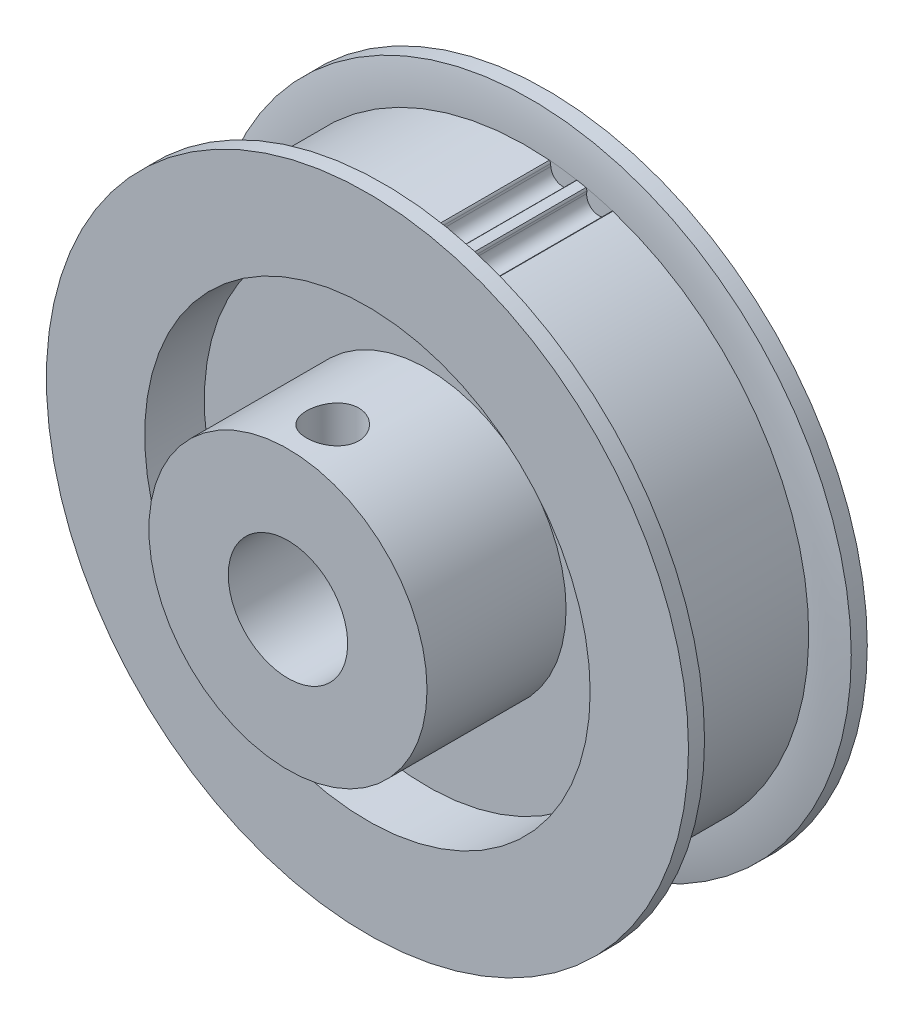
ISO-10303-21;
HEADER;
FILE_DESCRIPTION(('STEP AP214'),'2;1');
FILE_NAME('part.step','',(''),(''),'','','');
FILE_SCHEMA(('AUTOMOTIVE_DESIGN { 1 0 10303 214 1 1 1 1 }'));
ENDSEC;
DATA;
#1=APPLICATION_CONTEXT('core data for automotive mechanical design processes');
#2=APPLICATION_PROTOCOL_DEFINITION('international standard','automotive_design',2000,#1);
#3=PRODUCT_CONTEXT('',#1,'mechanical');
#4=PRODUCT('Part','Part','',(#3));
#5=PRODUCT_RELATED_PRODUCT_CATEGORY('part','',(#4));
#6=PRODUCT_DEFINITION_FORMATION('','',#4);
#7=PRODUCT_DEFINITION_CONTEXT('part definition',#1,'design');
#8=PRODUCT_DEFINITION('design','',#6,#7);
#9=PRODUCT_DEFINITION_SHAPE('','',#8);
#10=(LENGTH_UNIT() NAMED_UNIT(*) SI_UNIT(.MILLI.,.METRE.));
#11=(NAMED_UNIT(*) PLANE_ANGLE_UNIT() SI_UNIT($,.RADIAN.));
#12=(NAMED_UNIT(*) SI_UNIT($,.STERADIAN.) SOLID_ANGLE_UNIT());
#13=UNCERTAINTY_MEASURE_WITH_UNIT(LENGTH_MEASURE(1.E-05),#10,'distance_accuracy_value','');
#14=(GEOMETRIC_REPRESENTATION_CONTEXT(3) GLOBAL_UNCERTAINTY_ASSIGNED_CONTEXT((#13)) GLOBAL_UNIT_ASSIGNED_CONTEXT((#10,
#11,#12)) REPRESENTATION_CONTEXT('',''));
#15=CARTESIAN_POINT('',(0.,0.,0.));
#16=DIRECTION('',(0.,0.,1.));
#17=DIRECTION('',(1.,0.,0.));
#18=AXIS2_PLACEMENT_3D('',#15,#16,#17);
#19=CARTESIAN_POINT('',(0.,0.,13.49375));
#20=DIRECTION('',(0.,0.,-1.));
#21=DIRECTION('',(-1.,0.,0.));
#22=AXIS2_PLACEMENT_3D('',#19,#20,#21);
#23=CYLINDRICAL_SURFACE('',#22,4.76885);
#24=CARTESIAN_POINT('',(0.,0.,13.49375));
#25=DIRECTION('',(0.,0.,-1.));
#26=DIRECTION('',(-1.,0.,0.));
#27=AXIS2_PLACEMENT_3D('',#24,#25,#26);
#28=CIRCLE('',#27,4.76885);
#29=CARTESIAN_POINT('',(-4.76885,0.,13.49375));
#30=VERTEX_POINT('',#29);
#31=EDGE_CURVE('E617',#30,#30,#28,.T.);
#32=ORIENTED_EDGE('',*,*,#31,.F.);
#33=EDGE_LOOP('',(#32));
#34=FACE_BOUND('',#33,.T.);
#35=CARTESIAN_POINT('',(0.,0.,-7.14375));
#36=DIRECTION('',(0.,0.,-1.));
#37=DIRECTION('',(-1.,0.,0.));
#38=AXIS2_PLACEMENT_3D('',#35,#36,#37);
#39=CIRCLE('',#38,4.76885);
#40=CARTESIAN_POINT('',(-4.76885,0.,-7.14375));
#41=VERTEX_POINT('',#40);
#42=EDGE_CURVE('E254',#41,#41,#39,.T.);
#43=ORIENTED_EDGE('',*,*,#42,.T.);
#44=EDGE_LOOP('',(#43));
#45=FACE_BOUND('',#44,.T.);
#46=CARTESIAN_POINT('',(2.0828,4.28997371582857,9.921875));
#47=CARTESIAN_POINT('',(2.08279309475107,4.28998136636962,9.81124000228478));
#48=CARTESIAN_POINT('',(2.07393724770838,4.29431169526409,9.70051711326352));
#49=CARTESIAN_POINT('',(2.03891106593472,4.31104709896414,9.48239841307775));
#50=CARTESIAN_POINT('',(2.01271636747168,4.32346353558831,9.37500750646702));
#51=CARTESIAN_POINT('',(1.94425530841367,4.35467546817126,9.166974972437));
#52=CARTESIAN_POINT('',(1.90205167020731,4.37344603839647,9.06630878542764));
#53=CARTESIAN_POINT('',(1.80296547129025,4.41521536590945,8.8734792022932));
#54=CARTESIAN_POINT('',(1.74608108282824,4.43821464956885,8.78131686683734));
#55=CARTESIAN_POINT('',(1.61509684839342,4.48760300327386,8.60179281080022));
#56=CARTESIAN_POINT('',(1.54014765591728,4.5141138652434,8.51508404194297));
#57=CARTESIAN_POINT('',(1.37694542274111,4.56654080600722,8.35498283207335));
#58=CARTESIAN_POINT('',(1.28868783966035,4.5924566782279,8.28159495662932));
#59=CARTESIAN_POINT('',(1.09611831900581,4.64228433201052,8.14675565118863));
#60=CARTESIAN_POINT('',(0.991235223335877,4.66603787869313,8.08605608541773));
#61=CARTESIAN_POINT('',(0.771518415837138,4.70735109900776,7.98344922382903));
#62=CARTESIAN_POINT('',(0.656689464209303,4.72491371550679,7.94153299674875));
#63=CARTESIAN_POINT('',(0.42722385490403,4.75099776016712,7.88010275559826));
#64=CARTESIAN_POINT('',(0.312943081020079,4.75997405368847,7.85945656701402));
#65=CARTESIAN_POINT('',(0.0822107175918864,4.76953667799242,7.83747816722956));
#66=CARTESIAN_POINT('',(-0.0342398790906929,4.77012675608798,7.83613732958494));
#67=CARTESIAN_POINT('',(-0.257713381386158,4.76310674430949,7.85224930423773));
#68=CARTESIAN_POINT('',(-0.364846751639125,4.75604136106681,7.86845367292192));
#69=CARTESIAN_POINT('',(-0.574694702000241,4.73526956779998,7.91703497306919));
#70=CARTESIAN_POINT('',(-0.677408960381866,4.72156267513893,7.94941307987924));
#71=CARTESIAN_POINT('',(-0.877408037731759,4.68855252474446,8.02978386396776));
#72=CARTESIAN_POINT('',(-0.974585694051365,4.66916682238073,8.07800794639539));
#73=CARTESIAN_POINT('',(-1.15972227414466,4.62666293067236,8.18845916523614));
#74=CARTESIAN_POINT('',(-1.24767811416495,4.60354349930132,8.25069096404345));
#75=CARTESIAN_POINT('',(-1.41901082161496,4.5537778609263,8.39289337195162));
#76=CARTESIAN_POINT('',(-1.50152746103705,4.52699715512335,8.47385460848099));
#77=CARTESIAN_POINT('',(-1.65222780204918,4.47419993477714,8.64848930125989));
#78=CARTESIAN_POINT('',(-1.72040134774708,4.44818397286319,8.74217168824116));
#79=CARTESIAN_POINT('',(-1.84301917063421,4.39883602032637,8.94420057582878));
#80=CARTESIAN_POINT('',(-1.8968111805748,4.37565152920985,9.05298150214687));
#81=CARTESIAN_POINT('',(-1.98487978628287,4.33642034618802,9.27924646524431));
#82=CARTESIAN_POINT('',(-2.01919900299857,4.32035808253735,9.39671085373599));
#83=CARTESIAN_POINT('',(-2.05618980521605,4.302813946919,9.58311756240282));
#84=CARTESIAN_POINT('',(-2.06614873049357,4.29802447726948,9.65038075429822));
#85=CARTESIAN_POINT('',(-2.07945583391956,4.29160206405149,9.78570988346239));
#86=CARTESIAN_POINT('',(-2.08280425039088,4.28996900668771,9.85377579170252));
#87=CARTESIAN_POINT('',(-2.08279309475107,4.28998136636962,10.0325099977152));
#88=CARTESIAN_POINT('',(-2.07393724770838,4.29431169526409,10.1432328867365));
#89=CARTESIAN_POINT('',(-2.03891106593472,4.31104709896414,10.3613515869223));
#90=CARTESIAN_POINT('',(-2.01271636747168,4.32346353558831,10.468742493533));
#91=CARTESIAN_POINT('',(-1.94425530841367,4.35467546817126,10.676775027563));
#92=CARTESIAN_POINT('',(-1.90205167020731,4.37344603839647,10.7774412145724));
#93=CARTESIAN_POINT('',(-1.80296547129025,4.41521536590945,10.9702707977068));
#94=CARTESIAN_POINT('',(-1.74608108282824,4.43821464956885,11.0624331331627));
#95=CARTESIAN_POINT('',(-1.61509684839342,4.48760300327386,11.2419571891998));
#96=CARTESIAN_POINT('',(-1.54014765591728,4.5141138652434,11.328665958057));
#97=CARTESIAN_POINT('',(-1.37694542274111,4.56654080600722,11.4887671679267));
#98=CARTESIAN_POINT('',(-1.28868783966035,4.5924566782279,11.5621550433707));
#99=CARTESIAN_POINT('',(-1.09611831900581,4.64228433201052,11.6969943488114));
#100=CARTESIAN_POINT('',(-0.991235223335877,4.66603787869313,11.7576939145823));
#101=CARTESIAN_POINT('',(-0.771518415837138,4.70735109900776,11.860300776171));
#102=CARTESIAN_POINT('',(-0.656689464209303,4.72491371550679,11.9022170032512));
#103=CARTESIAN_POINT('',(-0.42722385490403,4.75099776016712,11.9636472444017));
#104=CARTESIAN_POINT('',(-0.312943081020079,4.75997405368847,11.984293432986));
#105=CARTESIAN_POINT('',(-0.0822107175918864,4.76953667799242,12.0062718327704));
#106=CARTESIAN_POINT('',(0.0342398790906928,4.77012675608798,12.0076126704151));
#107=CARTESIAN_POINT('',(0.257713381386158,4.76310674430949,11.9915006957623));
#108=CARTESIAN_POINT('',(0.364846751639126,4.75604136106681,11.9752963270781));
#109=CARTESIAN_POINT('',(0.574694702000241,4.73526956779998,11.9267150269308));
#110=CARTESIAN_POINT('',(0.677408960381866,4.72156267513893,11.8943369201208));
#111=CARTESIAN_POINT('',(0.877408037731759,4.68855252474446,11.8139661360322));
#112=CARTESIAN_POINT('',(0.974585694051366,4.66916682238073,11.7657420536046));
#113=CARTESIAN_POINT('',(1.15972227414466,4.62666293067236,11.6552908347639));
#114=CARTESIAN_POINT('',(1.24767811416495,4.60354349930132,11.5930590359565));
#115=CARTESIAN_POINT('',(1.41901082161496,4.5537778609263,11.4508566280484));
#116=CARTESIAN_POINT('',(1.50152746103705,4.52699715512335,11.369895391519));
#117=CARTESIAN_POINT('',(1.65222780204918,4.47419993477714,11.1952606987401));
#118=CARTESIAN_POINT('',(1.72040134774708,4.44818397286319,11.1015783117588));
#119=CARTESIAN_POINT('',(1.84301917063421,4.39883602032637,10.8995494241712));
#120=CARTESIAN_POINT('',(1.8968111805748,4.37565152920985,10.7907684978531));
#121=CARTESIAN_POINT('',(1.98487978628287,4.33642034618802,10.5645035347557));
#122=CARTESIAN_POINT('',(2.01919900299857,4.32035808253735,10.447039146264));
#123=CARTESIAN_POINT('',(2.05618980521605,4.302813946919,10.2606324375972));
#124=CARTESIAN_POINT('',(2.06614873049357,4.29802447726948,10.1933692457018));
#125=CARTESIAN_POINT('',(2.07945583391956,4.29160206405149,10.0580401165376));
#126=CARTESIAN_POINT('',(2.08280425039088,4.28996900668771,9.98997420829748));
#127=CARTESIAN_POINT('',(2.0828,4.28997371582857,9.921875));
#128=B_SPLINE_CURVE_WITH_KNOTS('',3,(#46,#47,#48,#49,#50,#51,#52,#53,#54,#55,#56,#57,#58,#59,
#60,#61,#62,#63,#64,#65,#66,#67,#68,#69,#70,#71,#72,#73,#74,#75,#76,#77,#78,#79,#80,#81,#82,#83,
#84,#85,#86,#87,#88,#89,#90,#91,#92,#93,#94,#95,#96,#97,#98,#99,#100,#101,#102,#103,#104,#105,
#106,#107,#108,#109,#110,#111,#112,#113,#114,#115,#116,#117,#118,#119,#120,#121,#122,#123,#124,
#125,#126,#127),.UNSPECIFIED.,.T.,.F.,(4,2,2,2,2,2,2,2,2,2,2,2,2,2,2,2,2,2,2,2,2,2,2,2,2,2,2,2,
2,2,2,2,2,2,2,2,2,2,2,2,4),(0.,0.331634089644654,0.663735167844799,0.994548306154675,
1.32540265053855,1.67679119125065,2.02829993948324,2.39686276450596,2.76525015568899,
3.11281830907529,3.46023114954032,3.7844552716246,4.10870295853275,4.43791344462378,
4.76723366914031,5.12165908020985,5.47633461036122,5.84508645370733,6.21302804927599,
6.41716628456894,6.6212971601115,6.95293124975616,7.2850323279563,7.61584546626618,
7.94669981065005,8.29808835136215,8.64959709959474,9.01815992461746,9.3865473158005,
9.73411546918679,10.0815283096518,10.4057524317361,10.7300001186443,11.0592106047353,
11.3885308292518,11.7429562403214,12.0976317704727,12.4663836138188,12.8343252093875,
13.0384634446804,13.242594320223),.UNSPECIFIED.);
#129=CARTESIAN_POINT('',(2.0828,4.28997371582857,9.921875));
#130=VERTEX_POINT('',#129);
#131=EDGE_CURVE('E20',#130,#130,#128,.T.);
#132=ORIENTED_EDGE('',*,*,#131,.T.);
#133=EDGE_LOOP('',(#132));
#134=FACE_BOUND('',#133,.T.);
#135=ADVANCED_FACE('F16',(#34,#45,#134),#23,.F.);
#136=CARTESIAN_POINT('',(0.,0.,9.921875));
#137=DIRECTION('',(0.,-1.,0.));
#138=DIRECTION('',(0.,0.,-1.));
#139=AXIS2_PLACEMENT_3D('',#136,#137,#138);
#140=CYLINDRICAL_SURFACE('',#139,2.0828);
#141=ORIENTED_EDGE('',*,*,#131,.F.);
#142=EDGE_LOOP('',(#141));
#143=FACE_BOUND('',#142,.T.);
#144=CARTESIAN_POINT('',(-2.0828,10.9155668845003,9.921875));
#145=CARTESIAN_POINT('',(-2.08279451870322,10.9155695521147,9.80610890856088));
#146=CARTESIAN_POINT('',(-2.07310680750056,10.9174302445742,9.69019737118905));
#147=CARTESIAN_POINT('',(-2.03461261859953,10.9246682364328,9.46155217987826));
#148=CARTESIAN_POINT('',(-2.00576784142357,10.9300525801229,9.34882536457389));
#149=CARTESIAN_POINT('',(-1.92987369555913,10.9437068297346,9.13002570161695));
#150=CARTESIAN_POINT('',(-1.88284938227105,10.9519727626584,9.02394392844773));
#151=CARTESIAN_POINT('',(-1.77199008673206,10.9704535051151,8.82121361348785));
#152=CARTESIAN_POINT('',(-1.70816089154809,10.9806676434152,8.72456183997905));
#153=CARTESIAN_POINT('',(-1.5646436596476,11.0020386436127,8.54217916164302));
#154=CARTESIAN_POINT('',(-1.48478526113422,11.0132048198182,8.45658337469522));
#155=CARTESIAN_POINT('',(-1.3118409728471,11.035139941498,8.29991783911949));
#156=CARTESIAN_POINT('',(-1.21875352149877,11.0459088398878,8.22884980778506));
#157=CARTESIAN_POINT('',(-1.02111982731094,11.0659339759225,8.10275106500442));
#158=CARTESIAN_POINT('',(-0.916491961362516,11.0751781098486,8.04784619386589));
#159=CARTESIAN_POINT('',(-0.699295780220666,11.0910090900187,7.95644377447584));
#160=CARTESIAN_POINT('',(-0.58672818619914,11.0975961772402,7.91994455687191));
#161=CARTESIAN_POINT('',(-0.358233822198065,11.1073058426618,7.86680260357779));
#162=CARTESIAN_POINT('',(-0.242361216770013,11.1104677510987,7.84993428163922));
#163=CARTESIAN_POINT('',(-0.00939016334509482,11.1131063593726,7.83583007589002));
#164=CARTESIAN_POINT('',(0.107708181484871,11.1125833669059,7.83859255287026));
#165=CARTESIAN_POINT('',(0.338258489104642,11.1079418438482,7.8634984603065));
#166=CARTESIAN_POINT('',(0.451737748701682,11.1038684079209,7.88539882681622));
#167=CARTESIAN_POINT('',(0.673382534098426,11.09263422991,7.94757472598846));
#168=CARTESIAN_POINT('',(0.781547824715982,11.0854733513213,7.98785107111295));
#169=CARTESIAN_POINT('',(0.990201637324353,11.0687932654257,8.08586873769446));
#170=CARTESIAN_POINT('',(1.09064315927851,11.0592609177952,8.1437077818697));
#171=CARTESIAN_POINT('',(1.28047813331861,11.0388930508956,8.27513241261653));
#172=CARTESIAN_POINT('',(1.36987128932932,11.0280574967184,8.34871842103258));
#173=CARTESIAN_POINT('',(1.53650535903474,11.0060887717127,8.51087320783914));
#174=CARTESIAN_POINT('',(1.61354176261637,10.9949535787603,8.59965198762546));
#175=CARTESIAN_POINT('',(1.75169654089587,10.9737923157302,8.78902275492326));
#176=CARTESIAN_POINT('',(1.812807808816,10.9637667419773,8.88961998760357));
#177=CARTESIAN_POINT('',(1.91743194115483,10.9459556771624,9.10007098084264));
#178=CARTESIAN_POINT('',(1.96090068731682,10.9381758157479,9.20994712699055));
#179=CARTESIAN_POINT('',(2.02861617629656,10.9258215339763,9.43547957639696));
#180=CARTESIAN_POINT('',(2.05290347475795,10.9212403529896,9.5511231317761));
#181=CARTESIAN_POINT('',(2.07243261364606,10.917540695784,9.71000477658558));
#182=CARTESIAN_POINT('',(2.07631712132487,10.91680221567,9.75227643770354));
#183=CARTESIAN_POINT('',(2.08150182144548,10.9158148205245,9.83698387853684));
#184=CARTESIAN_POINT('',(2.08280201017694,10.9155659061959,9.87941965848772));
#185=CARTESIAN_POINT('',(2.08279451870322,10.9155695521147,10.0376410914391));
#186=CARTESIAN_POINT('',(2.07310680750056,10.9174302445742,10.1535526288109));
#187=CARTESIAN_POINT('',(2.03461261859953,10.9246682364328,10.3821978201217));
#188=CARTESIAN_POINT('',(2.00576784142357,10.9300525801229,10.4949246354261));
#189=CARTESIAN_POINT('',(1.92987369555913,10.9437068297346,10.7137242983831));
#190=CARTESIAN_POINT('',(1.88284938227105,10.9519727626584,10.8198060715523));
#191=CARTESIAN_POINT('',(1.77199008673206,10.9704535051151,11.0225363865121));
#192=CARTESIAN_POINT('',(1.70816089154809,10.9806676434152,11.119188160021));
#193=CARTESIAN_POINT('',(1.5646436596476,11.0020386436127,11.301570838357));
#194=CARTESIAN_POINT('',(1.48478526113422,11.0132048198182,11.3871666253048));
#195=CARTESIAN_POINT('',(1.31184097284709,11.035139941498,11.5438321608805));
#196=CARTESIAN_POINT('',(1.21875352149877,11.0459088398878,11.6149001922149));
#197=CARTESIAN_POINT('',(1.02111982731093,11.0659339759225,11.7409989349956));
#198=CARTESIAN_POINT('',(0.916491961362516,11.0751781098486,11.7959038061341));
#199=CARTESIAN_POINT('',(0.699295780220665,11.0910090900187,11.8873062255242));
#200=CARTESIAN_POINT('',(0.58672818619914,11.0975961772402,11.9238054431281));
#201=CARTESIAN_POINT('',(0.358233822198066,11.1073058426618,11.9769473964222));
#202=CARTESIAN_POINT('',(0.242361216770013,11.1104677510987,11.9938157183608));
#203=CARTESIAN_POINT('',(0.00939016334509513,11.1131063593726,12.00791992411));
#204=CARTESIAN_POINT('',(-0.10770818148487,11.1125833669059,12.0051574471297));
#205=CARTESIAN_POINT('',(-0.338258489104643,11.1079418438482,11.9802515396935));
#206=CARTESIAN_POINT('',(-0.451737748701682,11.1038684079209,11.9583511731838));
#207=CARTESIAN_POINT('',(-0.673382534098427,11.09263422991,11.8961752740115));
#208=CARTESIAN_POINT('',(-0.781547824715983,11.0854733513213,11.8558989288871));
#209=CARTESIAN_POINT('',(-0.990201637324354,11.0687932654257,11.7578812623055));
#210=CARTESIAN_POINT('',(-1.09064315927852,11.0592609177952,11.7000422181303));
#211=CARTESIAN_POINT('',(-1.28047813331861,11.0388930508956,11.5686175873835));
#212=CARTESIAN_POINT('',(-1.36987128932932,11.0280574967184,11.4950315789674));
#213=CARTESIAN_POINT('',(-1.53650535903474,11.0060887717127,11.3328767921609));
#214=CARTESIAN_POINT('',(-1.61354176261637,10.9949535787603,11.2440980123745));
#215=CARTESIAN_POINT('',(-1.75169654089587,10.9737923157302,11.0547272450767));
#216=CARTESIAN_POINT('',(-1.812807808816,10.9637667419773,10.9541300123964));
#217=CARTESIAN_POINT('',(-1.91743194115483,10.9459556771624,10.7436790191574));
#218=CARTESIAN_POINT('',(-1.96090068731682,10.9381758157479,10.6338028730094));
#219=CARTESIAN_POINT('',(-2.02861617629656,10.9258215339763,10.408270423603));
#220=CARTESIAN_POINT('',(-2.05290347475795,10.9212403529896,10.2926268682239));
#221=CARTESIAN_POINT('',(-2.07243261364606,10.917540695784,10.1337452234144));
#222=CARTESIAN_POINT('',(-2.07631712132487,10.91680221567,10.0914735622965));
#223=CARTESIAN_POINT('',(-2.08150182144548,10.9158148205245,10.0067661214632));
#224=CARTESIAN_POINT('',(-2.08280201017694,10.9155659061959,9.96433034151228));
#225=CARTESIAN_POINT('',(-2.0828,10.9155668845003,9.921875));
#226=B_SPLINE_CURVE_WITH_KNOTS('',3,(#144,#145,#146,#147,#148,#149,#150,#151,#152,#153,#154,
#155,#156,#157,#158,#159,#160,#161,#162,#163,#164,#165,#166,#167,#168,#169,#170,#171,#172,#173,
#174,#175,#176,#177,#178,#179,#180,#181,#182,#183,#184,#185,#186,#187,#188,#189,#190,#191,#192,
#193,#194,#195,#196,#197,#198,#199,#200,#201,#202,#203,#204,#205,#206,#207,#208,#209,#210,#211,
#212,#213,#214,#215,#216,#217,#218,#219,#220,#221,#222,#223,#224,#225),.UNSPECIFIED.,.T.,.F.,(4,
2,2,2,2,2,2,2,2,2,2,2,2,2,2,2,2,2,2,2,2,2,2,2,2,2,2,2,2,2,2,2,2,2,2,2,2,2,2,2,4),(0.,
0.347135951853942,0.694968007638515,1.04232237358082,1.38955727783036,1.7406992539826,
2.09188271387108,2.44573212721095,2.79954944141039,3.14925945218384,3.49894026184786,
3.84424340236253,4.18956181133509,4.53683799585514,4.88412348470043,5.2366676821906,
5.58936893826297,5.94294683128017,6.29577513243204,6.42308144505628,6.55038794045524,
6.89752389230918,7.24535594809375,7.59271031403605,7.9399452182856,8.29108719443784,
8.64227065432632,8.99612006766619,9.34993738186563,9.69964739263908,10.0493282023031,
10.3946313428178,10.7399497517903,11.0872259363104,11.4345114251557,11.7870556226458,
12.1397568787182,12.4933347717354,12.8461630728873,12.9734693855115,13.1007758809105),.UNSPECIFIED.);
#227=CARTESIAN_POINT('',(-2.0828,10.9155668845003,9.921875));
#228=VERTEX_POINT('',#227);
#229=EDGE_CURVE('E248',#228,#228,#226,.T.);
#230=ORIENTED_EDGE('',*,*,#229,.F.);
#231=EDGE_LOOP('',(#230));
#232=FACE_BOUND('',#231,.T.);
#233=ADVANCED_FACE('F255',(#143,#232),#140,.F.);
#234=CARTESIAN_POINT('',(0.,0.,13.49375));
#235=DIRECTION('',(0.,0.,1.));
#236=DIRECTION('',(1.,0.,0.));
#237=AXIS2_PLACEMENT_3D('',#234,#235,#236);
#238=PLANE('',#237);
#239=ORIENTED_EDGE('',*,*,#31,.T.);
#240=EDGE_LOOP('',(#239));
#241=FACE_BOUND('',#240,.T.);
#242=CARTESIAN_POINT('',(0.,0.,13.49375));
#243=DIRECTION('',(0.,0.,1.));
#244=DIRECTION('',(1.,0.,0.));
#245=AXIS2_PLACEMENT_3D('',#242,#243,#244);
#246=CIRCLE('',#245,11.1125);
#247=CARTESIAN_POINT('',(11.1125,0.,13.49375));
#248=VERTEX_POINT('',#247);
#249=EDGE_CURVE('E245',#248,#248,#246,.F.);
#250=ORIENTED_EDGE('',*,*,#249,.F.);
#251=EDGE_LOOP('',(#250));
#252=FACE_BOUND('',#251,.T.);
#253=ADVANCED_FACE('F268',(#241,#252),#238,.T.);
#254=CARTESIAN_POINT('',(0.,0.,-7.14375));
#255=DIRECTION('',(0.,0.,1.));
#256=DIRECTION('',(1.,0.,0.));
#257=AXIS2_PLACEMENT_3D('',#254,#255,#256);
#258=PLANE('',#257);
#259=ORIENTED_EDGE('',*,*,#42,.F.);
#260=EDGE_LOOP('',(#259));
#261=FACE_BOUND('',#260,.T.);
#262=CARTESIAN_POINT('',(0.,0.,-7.14375));
#263=DIRECTION('',(0.,0.,1.));
#264=DIRECTION('',(1.,0.,0.));
#265=AXIS2_PLACEMENT_3D('',#262,#263,#264);
#266=CIRCLE('',#265,11.1125);
#267=CARTESIAN_POINT('',(11.1125,0.,-7.14375));
#268=VERTEX_POINT('',#267);
#269=EDGE_CURVE('E152',#268,#268,#266,.T.);
#270=ORIENTED_EDGE('',*,*,#269,.F.);
#271=EDGE_LOOP('',(#270));
#272=FACE_BOUND('',#271,.T.);
#273=ADVANCED_FACE('F264',(#261,#272),#258,.F.);
#274=CARTESIAN_POINT('',(0.,0.,7.14375));
#275=DIRECTION('',(0.,0.,1.));
#276=DIRECTION('',(1.,0.,0.));
#277=AXIS2_PLACEMENT_3D('',#274,#275,#276);
#278=CYLINDRICAL_SURFACE('',#277,11.1125);
#279=CARTESIAN_POINT('',(0.,0.,2.38125));
#280=DIRECTION('',(0.,0.,1.));
#281=DIRECTION('',(1.,0.,0.));
#282=AXIS2_PLACEMENT_3D('',#279,#280,#281);
#283=CIRCLE('',#282,11.1125);
#284=CARTESIAN_POINT('',(11.1125,0.,2.38125));
#285=VERTEX_POINT('',#284);
#286=EDGE_CURVE('E157',#285,#285,#283,.F.);
#287=ORIENTED_EDGE('',*,*,#286,.F.);
#288=EDGE_LOOP('',(#287));
#289=FACE_BOUND('',#288,.T.);
#290=ORIENTED_EDGE('',*,*,#249,.T.);
#291=EDGE_LOOP('',(#290));
#292=FACE_BOUND('',#291,.T.);
#293=ORIENTED_EDGE('',*,*,#229,.T.);
#294=EDGE_LOOP('',(#293));
#295=FACE_BOUND('',#294,.T.);
#296=ADVANCED_FACE('F258',(#289,#292,#295),#278,.T.);
#297=CARTESIAN_POINT('',(0.,0.,-7.14375));
#298=DIRECTION('',(0.,0.,1.));
#299=DIRECTION('',(1.,0.,0.));
#300=AXIS2_PLACEMENT_3D('',#297,#298,#299);
#301=CYLINDRICAL_SURFACE('',#300,11.1125);
#302=CARTESIAN_POINT('',(0.,0.,-2.38125));
#303=DIRECTION('',(0.,0.,1.));
#304=DIRECTION('',(1.,0.,0.));
#305=AXIS2_PLACEMENT_3D('',#302,#303,#304);
#306=CIRCLE('',#305,11.1125);
#307=CARTESIAN_POINT('',(11.1125,0.,-2.38125));
#308=VERTEX_POINT('',#307);
#309=EDGE_CURVE('E119',#308,#308,#306,.F.);
#310=ORIENTED_EDGE('',*,*,#309,.T.);
#311=EDGE_LOOP('',(#310));
#312=FACE_BOUND('',#311,.T.);
#313=ORIENTED_EDGE('',*,*,#269,.T.);
#314=EDGE_LOOP('',(#313));
#315=FACE_BOUND('',#314,.T.);
#316=ADVANCED_FACE('F263',(#312,#315),#301,.T.);
#317=CARTESIAN_POINT('',(0.,0.,-5.55625));
#318=DIRECTION('',(0.,0.,1.));
#319=DIRECTION('',(1.,0.,0.));
#320=AXIS2_PLACEMENT_3D('',#317,#318,#319);
#321=CYLINDRICAL_SURFACE('',#320,22.56155);
#322=CARTESIAN_POINT('',(0.,0.,5.55625));
#323=DIRECTION('',(0.,0.,1.));
#324=DIRECTION('',(1.,0.,0.));
#325=AXIS2_PLACEMENT_3D('',#322,#323,#324);
#326=CIRCLE('',#325,22.56155);
#327=CARTESIAN_POINT('',(4.03965572018997,22.196952945502,5.55625));
#328=VERTEX_POINT('',#327);
#329=CARTESIAN_POINT('',(4.76225090295466,22.0532198270411,5.55625));
#330=VERTEX_POINT('',#329);
#331=EDGE_CURVE('E151',#328,#330,#326,.F.);
#332=ORIENTED_EDGE('',*,*,#331,.T.);
#333=DIRECTION('',(0.,0.,1.));
#334=VECTOR('',#333,1.);
#335=CARTESIAN_POINT('',(4.76225090295506,22.0532198270414,5.55625));
#336=LINE('',#335,#334);
#337=CARTESIAN_POINT('',(4.76225090295466,22.0532198270411,-5.55625));
#338=VERTEX_POINT('',#337);
#339=EDGE_CURVE('E142',#338,#330,#336,.T.);
#340=ORIENTED_EDGE('',*,*,#339,.F.);
#341=CARTESIAN_POINT('',(0.,0.,-5.55625));
#342=DIRECTION('',(0.,0.,1.));
#343=DIRECTION('',(1.,0.,0.));
#344=AXIS2_PLACEMENT_3D('',#341,#342,#343);
#345=CIRCLE('',#344,22.56155);
#346=CARTESIAN_POINT('',(4.03965572018997,22.196952945502,-5.55625));
#347=VERTEX_POINT('',#346);
#348=EDGE_CURVE('E148',#338,#347,#345,.T.);
#349=ORIENTED_EDGE('',*,*,#348,.T.);
#350=DIRECTION('',(0.,0.,1.));
#351=VECTOR('',#350,1.);
#352=CARTESIAN_POINT('',(4.03965572019035,22.1969529455014,5.55625));
#353=LINE('',#352,#351);
#354=EDGE_CURVE('E116',#328,#347,#353,.F.);
#355=ORIENTED_EDGE('',*,*,#354,.F.);
#356=EDGE_LOOP('',(#332,#340,#349,#355));
#357=FACE_BOUND('',#356,.T.);
#358=ADVANCED_FACE('F447',(#357),#321,.T.);
#359=CARTESIAN_POINT('',(0.,0.,2.38125));
#360=DIRECTION('',(0.,0.,1.));
#361=DIRECTION('',(1.,0.,0.));
#362=AXIS2_PLACEMENT_3D('',#359,#360,#361);
#363=PLANE('',#362);
#364=ORIENTED_EDGE('',*,*,#286,.T.);
#365=EDGE_LOOP('',(#364));
#366=FACE_BOUND('',#365,.T.);
#367=CARTESIAN_POINT('',(0.,0.,2.38125));
#368=DIRECTION('',(0.,0.,1.));
#369=DIRECTION('',(1.,0.,0.));
#370=AXIS2_PLACEMENT_3D('',#367,#368,#369);
#371=CIRCLE('',#370,17.79905);
#372=CARTESIAN_POINT('',(17.79905,0.,2.38125));
#373=VERTEX_POINT('',#372);
#374=EDGE_CURVE('E136',#373,#373,#371,.T.);
#375=ORIENTED_EDGE('',*,*,#374,.T.);
#376=EDGE_LOOP('',(#375));
#377=FACE_BOUND('',#376,.T.);
#378=ADVANCED_FACE('F444',(#366,#377),#363,.T.);
#379=CARTESIAN_POINT('',(0.,0.,-2.38125));
#380=DIRECTION('',(0.,0.,1.));
#381=DIRECTION('',(1.,0.,0.));
#382=AXIS2_PLACEMENT_3D('',#379,#380,#381);
#383=PLANE('',#382);
#384=ORIENTED_EDGE('',*,*,#309,.F.);
#385=EDGE_LOOP('',(#384));
#386=FACE_BOUND('',#385,.T.);
#387=CARTESIAN_POINT('',(0.,0.,-2.38125));
#388=DIRECTION('',(0.,0.,1.));
#389=DIRECTION('',(1.,0.,0.));
#390=AXIS2_PLACEMENT_3D('',#387,#388,#389);
#391=CIRCLE('',#390,17.79905);
#392=CARTESIAN_POINT('',(17.79905,0.,-2.38125));
#393=VERTEX_POINT('',#392);
#394=EDGE_CURVE('E133',#393,#393,#391,.F.);
#395=ORIENTED_EDGE('',*,*,#394,.T.);
#396=EDGE_LOOP('',(#395));
#397=FACE_BOUND('',#396,.T.);
#398=ADVANCED_FACE('F441',(#386,#397),#383,.F.);
#399=CARTESIAN_POINT('',(4.18184412263996,21.9331072773375,5.55625));
#400=DIRECTION('',(0.,0.,1.));
#401=DIRECTION('',(1.,0.,0.));
#402=AXIS2_PLACEMENT_3D('',#399,#400,#401);
#403=CYLINDRICAL_SURFACE('',#402,0.29972);
#404=CARTESIAN_POINT('',(4.18184412263996,21.9331072773375,5.55625));
#405=DIRECTION('',(0.,0.,1.));
#406=DIRECTION('',(1.,0.,0.));
#407=AXIS2_PLACEMENT_3D('',#404,#405,#406);
#408=CIRCLE('',#407,0.29972);
#409=CARTESIAN_POINT('',(3.89919571363085,22.0328166313852,5.55625));
#410=VERTEX_POINT('',#409);
#411=EDGE_CURVE('E104',#410,#328,#408,.F.);
#412=ORIENTED_EDGE('',*,*,#411,.T.);
#413=ORIENTED_EDGE('',*,*,#354,.T.);
#414=CARTESIAN_POINT('',(4.18184412263996,21.9331072773375,-5.55625));
#415=DIRECTION('',(0.,0.,1.));
#416=DIRECTION('',(1.,0.,0.));
#417=AXIS2_PLACEMENT_3D('',#414,#415,#416);
#418=CIRCLE('',#417,0.29972);
#419=CARTESIAN_POINT('',(3.89919571363085,22.0328166313852,-5.55625));
#420=VERTEX_POINT('',#419);
#421=EDGE_CURVE('E109',#347,#420,#418,.T.);
#422=ORIENTED_EDGE('',*,*,#421,.T.);
#423=DIRECTION('',(0.,0.,1.));
#424=VECTOR('',#423,1.);
#425=CARTESIAN_POINT('',(3.89919571363092,22.0328166313852,5.55625));
#426=LINE('',#425,#424);
#427=EDGE_CURVE('E113',#410,#420,#426,.F.);
#428=ORIENTED_EDGE('',*,*,#427,.F.);
#429=EDGE_LOOP('',(#412,#413,#422,#428));
#430=FACE_BOUND('',#429,.T.);
#431=ADVANCED_FACE('F111',(#430),#403,.T.);
#432=CARTESIAN_POINT('',(4.52991658226454,21.863871360374,5.55625));
#433=DIRECTION('',(0.,0.,1.));
#434=DIRECTION('',(1.,0.,0.));
#435=AXIS2_PLACEMENT_3D('',#432,#433,#434);
#436=CYLINDRICAL_SURFACE('',#435,0.29972);
#437=CARTESIAN_POINT('',(4.52991658226454,21.863871360374,-5.55625));
#438=DIRECTION('',(0.,0.,1.));
#439=DIRECTION('',(1.,0.,0.));
#440=AXIS2_PLACEMENT_3D('',#437,#438,#439);
#441=CIRCLE('',#440,0.29972);
#442=CARTESIAN_POINT('',(4.82920678009047,21.8478259284666,-5.55625));
#443=VERTEX_POINT('',#442);
#444=EDGE_CURVE('E145',#443,#338,#441,.T.);
#445=ORIENTED_EDGE('',*,*,#444,.T.);
#446=ORIENTED_EDGE('',*,*,#339,.T.);
#447=CARTESIAN_POINT('',(4.52991658226454,21.863871360374,5.55625));
#448=DIRECTION('',(0.,0.,1.));
#449=DIRECTION('',(1.,0.,0.));
#450=AXIS2_PLACEMENT_3D('',#447,#448,#449);
#451=CIRCLE('',#450,0.29972);
#452=CARTESIAN_POINT('',(4.82920678009047,21.8478259284666,5.55625));
#453=VERTEX_POINT('',#452);
#454=EDGE_CURVE('E161',#330,#453,#451,.F.);
#455=ORIENTED_EDGE('',*,*,#454,.T.);
#456=DIRECTION('',(0.,0.,1.));
#457=VECTOR('',#456,1.);
#458=CARTESIAN_POINT('',(4.82920678009011,21.8478259284669,5.55625));
#459=LINE('',#458,#457);
#460=EDGE_CURVE('E140',#443,#453,#459,.T.);
#461=ORIENTED_EDGE('',*,*,#460,.F.);
#462=EDGE_LOOP('',(#445,#446,#455,#461));
#463=FACE_BOUND('',#462,.T.);
#464=ADVANCED_FACE('F434',(#463),#436,.T.);
#465=CARTESIAN_POINT('',(0.,0.,7.14375));
#466=DIRECTION('',(0.,0.,1.));
#467=DIRECTION('',(1.,0.,0.));
#468=AXIS2_PLACEMENT_3D('',#465,#466,#467);
#469=CYLINDRICAL_SURFACE('',#468,17.79905);
#470=ORIENTED_EDGE('',*,*,#374,.F.);
#471=EDGE_LOOP('',(#470));
#472=FACE_BOUND('',#471,.T.);
#473=CARTESIAN_POINT('',(0.,0.,7.14375));
#474=DIRECTION('',(0.,0.,1.));
#475=DIRECTION('',(1.,0.,0.));
#476=AXIS2_PLACEMENT_3D('',#473,#474,#475);
#477=CIRCLE('',#476,17.79905);
#478=CARTESIAN_POINT('',(17.79905,0.,7.14375));
#479=VERTEX_POINT('',#478);
#480=EDGE_CURVE('E216',#479,#479,#477,.F.);
#481=ORIENTED_EDGE('',*,*,#480,.F.);
#482=EDGE_LOOP('',(#481));
#483=FACE_BOUND('',#482,.T.);
#484=ADVANCED_FACE('F430',(#472,#483),#469,.F.);
#485=CARTESIAN_POINT('',(0.,0.,-7.14375));
#486=DIRECTION('',(0.,0.,1.));
#487=DIRECTION('',(1.,0.,0.));
#488=AXIS2_PLACEMENT_3D('',#485,#486,#487);
#489=CYLINDRICAL_SURFACE('',#488,17.79905);
#490=ORIENTED_EDGE('',*,*,#394,.F.);
#491=EDGE_LOOP('',(#490));
#492=FACE_BOUND('',#491,.T.);
#493=CARTESIAN_POINT('',(0.,0.,-7.14375));
#494=DIRECTION('',(0.,0.,1.));
#495=DIRECTION('',(1.,0.,0.));
#496=AXIS2_PLACEMENT_3D('',#493,#494,#495);
#497=CIRCLE('',#496,17.79905);
#498=CARTESIAN_POINT('',(17.79905,0.,-7.14375));
#499=VERTEX_POINT('',#498);
#500=EDGE_CURVE('E212',#499,#499,#497,.F.);
#501=ORIENTED_EDGE('',*,*,#500,.T.);
#502=EDGE_LOOP('',(#501));
#503=FACE_BOUND('',#502,.T.);
#504=ADVANCED_FACE('F427',(#492,#503),#489,.F.);
#505=CARTESIAN_POINT('',(14.678160463981,18.2303412651653,5.55625));
#506=DIRECTION('',(0.,0.,1.));
#507=DIRECTION('',(1.,0.,0.));
#508=AXIS2_PLACEMENT_3D('',#505,#506,#507);
#509=CYLINDRICAL_SURFACE('',#508,11.43);
#510=DIRECTION('',(0.,0.,1.));
#511=VECTOR('',#510,1.);
#512=CARTESIAN_POINT('',(3.8379045007576,21.8543929551625,5.55625));
#513=LINE('',#512,#511);
#514=CARTESIAN_POINT('',(3.83790450075681,21.854392955162,-5.55625));
#515=VERTEX_POINT('',#514);
#516=CARTESIAN_POINT('',(3.83790450075681,21.854392955162,5.55625));
#517=VERTEX_POINT('',#516);
#518=EDGE_CURVE('E215',#515,#517,#513,.T.);
#519=ORIENTED_EDGE('',*,*,#518,.T.);
#520=CARTESIAN_POINT('',(14.678160463981,18.2303412651653,5.55625));
#521=DIRECTION('',(0.,0.,1.));
#522=DIRECTION('',(1.,0.,0.));
#523=AXIS2_PLACEMENT_3D('',#520,#521,#522);
#524=CIRCLE('',#523,11.43);
#525=EDGE_CURVE('E130',#517,#410,#524,.F.);
#526=ORIENTED_EDGE('',*,*,#525,.T.);
#527=ORIENTED_EDGE('',*,*,#427,.T.);
#528=CARTESIAN_POINT('',(14.678160463981,18.2303412651653,-5.55625));
#529=DIRECTION('',(0.,0.,1.));
#530=DIRECTION('',(1.,0.,0.));
#531=AXIS2_PLACEMENT_3D('',#528,#529,#530);
#532=CIRCLE('',#531,11.43);
#533=EDGE_CURVE('E122',#420,#515,#532,.T.);
#534=ORIENTED_EDGE('',*,*,#533,.T.);
#535=EDGE_LOOP('',(#519,#526,#527,#534));
#536=FACE_BOUND('',#535,.T.);
#537=ADVANCED_FACE('F132',(#536),#509,.T.);
#538=CARTESIAN_POINT('',(-6.58440245904784,22.4597279927427,5.55625));
#539=DIRECTION('',(0.,0.,1.));
#540=DIRECTION('',(1.,0.,0.));
#541=AXIS2_PLACEMENT_3D('',#538,#539,#540);
#542=CYLINDRICAL_SURFACE('',#541,11.43);
#543=ORIENTED_EDGE('',*,*,#460,.T.);
#544=CARTESIAN_POINT('',(-6.58440245904784,22.4597279927427,5.55625));
#545=DIRECTION('',(0.,0.,1.));
#546=DIRECTION('',(1.,0.,0.));
#547=AXIS2_PLACEMENT_3D('',#544,#545,#546);
#548=CIRCLE('',#547,11.43);
#549=CARTESIAN_POINT('',(4.81755269235569,21.659528814171,5.55625));
#550=VERTEX_POINT('',#549);
#551=EDGE_CURVE('E219',#453,#550,#548,.F.);
#552=ORIENTED_EDGE('',*,*,#551,.T.);
#553=DIRECTION('',(0.,0.,1.));
#554=VECTOR('',#553,1.);
#555=CARTESIAN_POINT('',(4.81755269235585,21.6595288141704,5.55625));
#556=LINE('',#555,#554);
#557=CARTESIAN_POINT('',(4.81755269235569,21.659528814171,-5.55625));
#558=VERTEX_POINT('',#557);
#559=EDGE_CURVE('E209',#550,#558,#556,.F.);
#560=ORIENTED_EDGE('',*,*,#559,.T.);
#561=CARTESIAN_POINT('',(-6.58440245904784,22.4597279927427,-5.55625));
#562=DIRECTION('',(0.,0.,1.));
#563=DIRECTION('',(1.,0.,0.));
#564=AXIS2_PLACEMENT_3D('',#561,#562,#563);
#565=CIRCLE('',#564,11.43);
#566=EDGE_CURVE('E221',#558,#443,#565,.T.);
#567=ORIENTED_EDGE('',*,*,#566,.T.);
#568=EDGE_LOOP('',(#543,#552,#560,#567));
#569=FACE_BOUND('',#568,.T.);
#570=ADVANCED_FACE('F420',(#569),#542,.T.);
#571=CARTESIAN_POINT('',(0.,0.,7.14375));
#572=DIRECTION('',(0.,0.,1.));
#573=DIRECTION('',(1.,0.,0.));
#574=AXIS2_PLACEMENT_3D('',#571,#572,#573);
#575=PLANE('',#574);
#576=ORIENTED_EDGE('',*,*,#480,.T.);
#577=EDGE_LOOP('',(#576));
#578=FACE_BOUND('',#577,.T.);
#579=CARTESIAN_POINT('',(0.,0.,7.14375));
#580=DIRECTION('',(0.,0.,1.));
#581=DIRECTION('',(1.,0.,0.));
#582=AXIS2_PLACEMENT_3D('',#579,#580,#581);
#583=CIRCLE('',#582,25.654);
#584=CARTESIAN_POINT('',(25.654,0.,7.14375));
#585=VERTEX_POINT('',#584);
#586=EDGE_CURVE('E201',#585,#585,#583,.F.);
#587=ORIENTED_EDGE('',*,*,#586,.F.);
#588=EDGE_LOOP('',(#587));
#589=FACE_BOUND('',#588,.T.);
#590=ADVANCED_FACE('F416',(#578,#589),#575,.T.);
#591=CARTESIAN_POINT('',(0.,0.,-7.14375));
#592=DIRECTION('',(0.,0.,1.));
#593=DIRECTION('',(1.,0.,0.));
#594=AXIS2_PLACEMENT_3D('',#591,#592,#593);
#595=PLANE('',#594);
#596=ORIENTED_EDGE('',*,*,#500,.F.);
#597=EDGE_LOOP('',(#596));
#598=FACE_BOUND('',#597,.T.);
#599=CARTESIAN_POINT('',(0.,0.,-7.14375));
#600=DIRECTION('',(0.,0.,1.));
#601=DIRECTION('',(1.,0.,0.));
#602=AXIS2_PLACEMENT_3D('',#599,#600,#601);
#603=CIRCLE('',#602,25.654);
#604=CARTESIAN_POINT('',(25.654,0.,-7.14375));
#605=VERTEX_POINT('',#604);
#606=EDGE_CURVE('E188',#605,#605,#603,.T.);
#607=ORIENTED_EDGE('',*,*,#606,.F.);
#608=EDGE_LOOP('',(#607));
#609=FACE_BOUND('',#608,.T.);
#610=ADVANCED_FACE('F412',(#598,#609),#595,.F.);
#611=CARTESIAN_POINT('',(2.91768721676782,22.1620346764008,5.55625));
#612=DIRECTION('',(0.,0.,1.));
#613=DIRECTION('',(1.,0.,0.));
#614=AXIS2_PLACEMENT_3D('',#611,#612,#613);
#615=CYLINDRICAL_SURFACE('',#614,0.97028);
#616=CARTESIAN_POINT('',(2.91768721676782,22.1620346764008,-5.55625));
#617=DIRECTION('',(0.,0.,1.));
#618=DIRECTION('',(1.,0.,0.));
#619=AXIS2_PLACEMENT_3D('',#616,#617,#618);
#620=CIRCLE('',#619,0.97028);
#621=CARTESIAN_POINT('',(1.94920203983943,22.1030453513411,-5.55625));
#622=VERTEX_POINT('',#621);
#623=EDGE_CURVE('E126',#622,#515,#620,.T.);
#624=ORIENTED_EDGE('',*,*,#623,.F.);
#625=DIRECTION('',(0.,0.,1.));
#626=VECTOR('',#625,1.);
#627=CARTESIAN_POINT('',(1.94920203983885,22.1030453513418,5.55625));
#628=LINE('',#627,#626);
#629=CARTESIAN_POINT('',(1.94920203983943,22.1030453513411,5.55625));
#630=VERTEX_POINT('',#629);
#631=EDGE_CURVE('E194',#630,#622,#628,.F.);
#632=ORIENTED_EDGE('',*,*,#631,.F.);
#633=CARTESIAN_POINT('',(2.91768721676782,22.1620346764008,5.55625));
#634=DIRECTION('',(0.,0.,1.));
#635=DIRECTION('',(1.,0.,0.));
#636=AXIS2_PLACEMENT_3D('',#633,#634,#635);
#637=CIRCLE('',#636,0.97028);
#638=EDGE_CURVE('E204',#630,#517,#637,.T.);
#639=ORIENTED_EDGE('',*,*,#638,.T.);
#640=ORIENTED_EDGE('',*,*,#518,.F.);
#641=EDGE_LOOP('',(#624,#632,#639,#640));
#642=FACE_BOUND('',#641,.T.);
#643=ADVANCED_FACE('F408',(#642),#615,.F.);
#644=CARTESIAN_POINT('',(5.7854519963195,21.5916007950128,5.55625));
#645=DIRECTION('',(0.,0.,1.));
#646=DIRECTION('',(1.,0.,0.));
#647=AXIS2_PLACEMENT_3D('',#644,#645,#646);
#648=CYLINDRICAL_SURFACE('',#647,0.97028);
#649=CARTESIAN_POINT('',(5.7854519963195,21.5916007950128,-5.55625));
#650=DIRECTION('',(0.,0.,1.));
#651=DIRECTION('',(1.,0.,0.));
#652=AXIS2_PLACEMENT_3D('',#649,#650,#651);
#653=CIRCLE('',#652,0.97028);
#654=CARTESIAN_POINT('',(6.6576413914365,21.1664785332506,-5.55625));
#655=VERTEX_POINT('',#654);
#656=EDGE_CURVE('E181',#558,#655,#653,.T.);
#657=ORIENTED_EDGE('',*,*,#656,.F.);
#658=ORIENTED_EDGE('',*,*,#559,.F.);
#659=CARTESIAN_POINT('',(5.7854519963195,21.5916007950128,5.55625));
#660=DIRECTION('',(0.,0.,1.));
#661=DIRECTION('',(1.,0.,0.));
#662=AXIS2_PLACEMENT_3D('',#659,#660,#661);
#663=CIRCLE('',#662,0.97028);
#664=CARTESIAN_POINT('',(6.6576413914365,21.1664785332506,5.55625));
#665=VERTEX_POINT('',#664);
#666=EDGE_CURVE('E197',#550,#665,#663,.T.);
#667=ORIENTED_EDGE('',*,*,#666,.T.);
#668=DIRECTION('',(0.,0.,1.));
#669=VECTOR('',#668,1.);
#670=CARTESIAN_POINT('',(6.65764139143644,21.1664785332501,5.55625));
#671=LINE('',#670,#669);
#672=EDGE_CURVE('E175',#655,#665,#671,.T.);
#673=ORIENTED_EDGE('',*,*,#672,.F.);
#674=EDGE_LOOP('',(#657,#658,#667,#673));
#675=FACE_BOUND('',#674,.T.);
#676=ADVANCED_FACE('F396',(#675),#648,.F.);
#677=CARTESIAN_POINT('',(0.,0.,5.55625));
#678=DIRECTION('',(0.,0.,1.));
#679=DIRECTION('',(1.,0.,0.));
#680=AXIS2_PLACEMENT_3D('',#677,#678,#679);
#681=PLANE('',#680);
#682=ORIENTED_EDGE('',*,*,#525,.F.);
#683=ORIENTED_EDGE('',*,*,#638,.F.);
#684=CARTESIAN_POINT('',(-9.45965475643116,21.4081449252349,5.55625));
#685=DIRECTION('',(0.,0.,1.));
#686=DIRECTION('',(1.,0.,0.));
#687=AXIS2_PLACEMENT_3D('',#684,#685,#686);
#688=CIRCLE('',#687,11.43);
#689=CARTESIAN_POINT('',(1.93617871990229,22.2912527214161,5.55625));
#690=VERTEX_POINT('',#689);
#691=EDGE_CURVE('E191',#690,#630,#688,.F.);
#692=ORIENTED_EDGE('',*,*,#691,.F.);
#693=CARTESIAN_POINT('',(1.63735464207843,22.2680956725385,5.55625));
#694=DIRECTION('',(0.,0.,1.));
#695=DIRECTION('',(1.,0.,0.));
#696=AXIS2_PLACEMENT_3D('',#693,#694,#695);
#697=CIRCLE('',#696,0.29972);
#698=CARTESIAN_POINT('',(1.84298637609191,22.4861499510263,5.55625));
#699=VERTEX_POINT('',#698);
#700=EDGE_CURVE('E207',#699,#690,#697,.F.);
#701=ORIENTED_EDGE('',*,*,#700,.F.);
#702=CARTESIAN_POINT('',(0.,0.,5.55625));
#703=DIRECTION('',(0.,0.,1.));
#704=DIRECTION('',(0.179050451772584,0.983839893336326,0.));
#705=AXIS2_PLACEMENT_3D('',#702,#703,#704);
#706=CIRCLE('',#705,22.5615500000002);
#707=EDGE_CURVE('E174',#328,#699,#706,.T.);
#708=ORIENTED_EDGE('',*,*,#707,.F.);
#709=ORIENTED_EDGE('',*,*,#411,.F.);
#710=EDGE_LOOP('',(#682,#683,#692,#701,#708,#709));
#711=FACE_BOUND('',#710,.T.);
#712=ADVANCED_FACE('F391',(#711),#681,.F.);
#713=CARTESIAN_POINT('',(0.,0.,5.55625));
#714=DIRECTION('',(0.,0.,1.));
#715=DIRECTION('',(1.,0.,0.));
#716=AXIS2_PLACEMENT_3D('',#713,#714,#715);
#717=CYLINDRICAL_SURFACE('',#716,25.654);
#718=ORIENTED_EDGE('',*,*,#586,.T.);
#719=EDGE_LOOP('',(#718));
#720=FACE_BOUND('',#719,.T.);
#721=CARTESIAN_POINT('',(0.,0.,5.86197606392816));
#722=DIRECTION('',(0.,0.,-1.));
#723=DIRECTION('',(0.,-1.,0.));
#724=AXIS2_PLACEMENT_3D('',#721,#722,#723);
#725=CIRCLE('',#724,25.6540000000001);
#726=CARTESIAN_POINT('',(0.,-25.6540000000001,5.86197606392816));
#727=VERTEX_POINT('',#726);
#728=EDGE_CURVE('E346',#727,#727,#725,.T.);
#729=ORIENTED_EDGE('',*,*,#728,.F.);
#730=EDGE_LOOP('',(#729));
#731=FACE_BOUND('',#730,.T.);
#732=ADVANCED_FACE('F387',(#720,#731),#717,.T.);
#733=CARTESIAN_POINT('',(0.,0.,5.55625));
#734=DIRECTION('',(0.,0.,1.));
#735=DIRECTION('',(1.,0.,0.));
#736=AXIS2_PLACEMENT_3D('',#733,#734,#735);
#737=PLANE('',#736);
#738=CARTESIAN_POINT('',(16.9321237946484,16.1584937742788,5.55625));
#739=DIRECTION('',(0.,0.,1.));
#740=DIRECTION('',(1.,0.,0.));
#741=AXIS2_PLACEMENT_3D('',#738,#739,#740);
#742=CIRCLE('',#741,11.43);
#743=CARTESIAN_POINT('',(6.74169721254836,21.3353756615585,5.55625));
#744=VERTEX_POINT('',#743);
#745=EDGE_CURVE('E171',#665,#744,#742,.F.);
#746=ORIENTED_EDGE('',*,*,#745,.F.);
#747=ORIENTED_EDGE('',*,*,#666,.F.);
#748=ORIENTED_EDGE('',*,*,#551,.F.);
#749=ORIENTED_EDGE('',*,*,#454,.F.);
#750=CARTESIAN_POINT('',(0.,0.,5.55625));
#751=DIRECTION('',(0.,0.,1.));
#752=DIRECTION('',(0.305935525367977,0.952052232977698,0.));
#753=AXIS2_PLACEMENT_3D('',#750,#751,#752);
#754=CIRCLE('',#753,22.5615499999995);
#755=CARTESIAN_POINT('',(6.90237965236577,21.4797740569375,5.55625));
#756=VERTEX_POINT('',#755);
#757=EDGE_CURVE('E348',#756,#330,#754,.T.);
#758=ORIENTED_EDGE('',*,*,#757,.F.);
#759=CARTESIAN_POINT('',(7.00891284292352,21.1996263142922,5.55625));
#760=DIRECTION('',(0.,0.,1.));
#761=DIRECTION('',(1.,0.,0.));
#762=AXIS2_PLACEMENT_3D('',#759,#760,#761);
#763=CIRCLE('',#762,0.29972);
#764=EDGE_CURVE('E195',#744,#756,#763,.F.);
#765=ORIENTED_EDGE('',*,*,#764,.F.);
#766=EDGE_LOOP('',(#746,#747,#748,#749,#758,#765));
#767=FACE_BOUND('',#766,.T.);
#768=ADVANCED_FACE('F376',(#767),#737,.F.);
#769=CARTESIAN_POINT('',(-9.45965475643116,21.4081449252349,5.55625));
#770=DIRECTION('',(0.,0.,1.));
#771=DIRECTION('',(1.,0.,0.));
#772=AXIS2_PLACEMENT_3D('',#769,#770,#771);
#773=CYLINDRICAL_SURFACE('',#772,11.43);
#774=DIRECTION('',(0.,0.,1.));
#775=VECTOR('',#774,1.);
#776=CARTESIAN_POINT('',(1.93617871990229,22.2912527214161,5.55625));
#777=LINE('',#776,#775);
#778=CARTESIAN_POINT('',(1.93617871990233,22.2912527214161,-5.55625));
#779=VERTEX_POINT('',#778);
#780=EDGE_CURVE('E168',#690,#779,#777,.F.);
#781=ORIENTED_EDGE('',*,*,#780,.F.);
#782=ORIENTED_EDGE('',*,*,#691,.T.);
#783=ORIENTED_EDGE('',*,*,#631,.T.);
#784=CARTESIAN_POINT('',(-9.45965475643116,21.4081449252349,-5.55625));
#785=DIRECTION('',(0.,0.,1.));
#786=DIRECTION('',(1.,0.,0.));
#787=AXIS2_PLACEMENT_3D('',#784,#785,#786);
#788=CIRCLE('',#787,11.43);
#789=EDGE_CURVE('E186',#779,#622,#788,.F.);
#790=ORIENTED_EDGE('',*,*,#789,.F.);
#791=EDGE_LOOP('',(#781,#782,#783,#790));
#792=FACE_BOUND('',#791,.T.);
#793=ADVANCED_FACE('F386',(#792),#773,.T.);
#794=CARTESIAN_POINT('',(0.,0.,-5.55625));
#795=DIRECTION('',(0.,0.,1.));
#796=DIRECTION('',(1.,0.,0.));
#797=AXIS2_PLACEMENT_3D('',#794,#795,#796);
#798=CYLINDRICAL_SURFACE('',#797,25.654);
#799=ORIENTED_EDGE('',*,*,#606,.T.);
#800=EDGE_LOOP('',(#799));
#801=FACE_BOUND('',#800,.T.);
#802=CARTESIAN_POINT('',(0.,0.,-5.86197606392816));
#803=DIRECTION('',(0.,0.,-1.));
#804=DIRECTION('',(0.,-1.,0.));
#805=AXIS2_PLACEMENT_3D('',#802,#803,#804);
#806=CIRCLE('',#805,25.6540000000001);
#807=CARTESIAN_POINT('',(0.,-25.6540000000001,-5.86197606392816));
#808=VERTEX_POINT('',#807);
#809=EDGE_CURVE('E167',#808,#808,#806,.F.);
#810=ORIENTED_EDGE('',*,*,#809,.F.);
#811=EDGE_LOOP('',(#810));
#812=FACE_BOUND('',#811,.T.);
#813=ADVANCED_FACE('F488',(#801,#812),#798,.T.);
#814=CARTESIAN_POINT('',(0.,0.,-5.55625));
#815=DIRECTION('',(0.,0.,1.));
#816=DIRECTION('',(1.,0.,0.));
#817=AXIS2_PLACEMENT_3D('',#814,#815,#816);
#818=PLANE('',#817);
#819=ORIENTED_EDGE('',*,*,#421,.F.);
#820=CARTESIAN_POINT('',(0.,0.,-5.55625));
#821=DIRECTION('',(0.,0.,-1.));
#822=DIRECTION('',(0.0816870461511647,0.996658028859999,0.));
#823=AXIS2_PLACEMENT_3D('',#820,#821,#822);
#824=CIRCLE('',#823,22.5615499999999);
#825=CARTESIAN_POINT('',(1.84298637609188,22.4861499510263,-5.55625));
#826=VERTEX_POINT('',#825);
#827=EDGE_CURVE('E343',#826,#347,#824,.T.);
#828=ORIENTED_EDGE('',*,*,#827,.F.);
#829=CARTESIAN_POINT('',(1.63735464207843,22.2680956725385,-5.55625));
#830=DIRECTION('',(0.,0.,1.));
#831=DIRECTION('',(1.,0.,0.));
#832=AXIS2_PLACEMENT_3D('',#829,#830,#831);
#833=CIRCLE('',#832,0.29972);
#834=EDGE_CURVE('E164',#779,#826,#833,.T.);
#835=ORIENTED_EDGE('',*,*,#834,.F.);
#836=ORIENTED_EDGE('',*,*,#789,.T.);
#837=ORIENTED_EDGE('',*,*,#623,.T.);
#838=ORIENTED_EDGE('',*,*,#533,.F.);
#839=EDGE_LOOP('',(#819,#828,#835,#836,#837,#838));
#840=FACE_BOUND('',#839,.T.);
#841=ADVANCED_FACE('F123',(#840),#818,.T.);
#842=CARTESIAN_POINT('',(0.,0.,-5.55625));
#843=DIRECTION('',(0.,0.,1.));
#844=DIRECTION('',(1.,0.,0.));
#845=AXIS2_PLACEMENT_3D('',#842,#843,#844);
#846=PLANE('',#845);
#847=CARTESIAN_POINT('',(7.00891284292352,21.1996263142922,-5.55625));
#848=DIRECTION('',(0.,0.,1.));
#849=DIRECTION('',(1.,0.,0.));
#850=AXIS2_PLACEMENT_3D('',#847,#848,#849);
#851=CIRCLE('',#850,0.29972);
#852=CARTESIAN_POINT('',(6.74169721254836,21.3353756615585,-5.55625));
#853=VERTEX_POINT('',#852);
#854=CARTESIAN_POINT('',(6.90237965236577,21.4797740569376,-5.55625));
#855=VERTEX_POINT('',#854);
#856=EDGE_CURVE('E179',#853,#855,#851,.F.);
#857=ORIENTED_EDGE('',*,*,#856,.T.);
#858=CARTESIAN_POINT('',(0.,0.,-5.55625));
#859=DIRECTION('',(0.,0.,-1.));
#860=DIRECTION('',(0.211078179600004,0.977469182172384,0.));
#861=AXIS2_PLACEMENT_3D('',#858,#859,#860);
#862=CIRCLE('',#861,22.5615499999995);
#863=EDGE_CURVE('E336',#338,#855,#862,.T.);
#864=ORIENTED_EDGE('',*,*,#863,.F.);
#865=ORIENTED_EDGE('',*,*,#444,.F.);
#866=ORIENTED_EDGE('',*,*,#566,.F.);
#867=ORIENTED_EDGE('',*,*,#656,.T.);
#868=CARTESIAN_POINT('',(16.9321237946484,16.1584937742788,-5.55625));
#869=DIRECTION('',(0.,0.,1.));
#870=DIRECTION('',(1.,0.,0.));
#871=AXIS2_PLACEMENT_3D('',#868,#869,#870);
#872=CIRCLE('',#871,11.43);
#873=EDGE_CURVE('E176',#853,#655,#872,.T.);
#874=ORIENTED_EDGE('',*,*,#873,.F.);
#875=EDGE_LOOP('',(#857,#864,#865,#866,#867,#874));
#876=FACE_BOUND('',#875,.T.);
#877=ADVANCED_FACE('F460',(#876),#846,.T.);
#878=CARTESIAN_POINT('',(16.9321237946484,16.1584937742788,5.55625));
#879=DIRECTION('',(0.,0.,1.));
#880=DIRECTION('',(1.,0.,0.));
#881=AXIS2_PLACEMENT_3D('',#878,#879,#880);
#882=CYLINDRICAL_SURFACE('',#881,11.43);
#883=ORIENTED_EDGE('',*,*,#672,.T.);
#884=ORIENTED_EDGE('',*,*,#745,.T.);
#885=DIRECTION('',(0.,0.,1.));
#886=VECTOR('',#885,1.);
#887=CARTESIAN_POINT('',(6.74169721254825,21.3353756615582,5.55625));
#888=LINE('',#887,#886);
#889=EDGE_CURVE('E332',#853,#744,#888,.T.);
#890=ORIENTED_EDGE('',*,*,#889,.F.);
#891=ORIENTED_EDGE('',*,*,#873,.T.);
#892=EDGE_LOOP('',(#883,#884,#890,#891));
#893=FACE_BOUND('',#892,.T.);
#894=ADVANCED_FACE('F309',(#893),#882,.T.);
#895=CARTESIAN_POINT('',(0.,0.,21.349335));
#896=DIRECTION('',(0.,0.,-1.));
#897=DIRECTION('',(0.,-1.,0.));
#898=AXIS2_PLACEMENT_3D('',#895,#896,#897);
#899=TOROIDAL_SURFACE('',#898,22.56155,15.793085);
#900=ORIENTED_EDGE('',*,*,#728,.T.);
#901=EDGE_LOOP('',(#900));
#902=FACE_BOUND('',#901,.T.);
#903=CARTESIAN_POINT('',(0.,0.,5.55625));
#904=DIRECTION('',(0.,0.,1.));
#905=DIRECTION('',(1.,0.,0.));
#906=AXIS2_PLACEMENT_3D('',#903,#904,#905);
#907=CIRCLE('',#906,22.56155);
#908=EDGE_CURVE('E335',#756,#699,#907,.F.);
#909=ORIENTED_EDGE('',*,*,#908,.F.);
#910=ORIENTED_EDGE('',*,*,#757,.T.);
#911=ORIENTED_EDGE('',*,*,#331,.F.);
#912=ORIENTED_EDGE('',*,*,#707,.T.);
#913=EDGE_LOOP('',(#909,#910,#911,#912));
#914=FACE_BOUND('',#913,.T.);
#915=ADVANCED_FACE('F305',(#902,#914),#899,.T.);
#916=CARTESIAN_POINT('',(1.63735464207843,22.2680956725385,5.55625));
#917=DIRECTION('',(0.,0.,1.));
#918=DIRECTION('',(1.,0.,0.));
#919=AXIS2_PLACEMENT_3D('',#916,#917,#918);
#920=CYLINDRICAL_SURFACE('',#919,0.29972);
#921=ORIENTED_EDGE('',*,*,#834,.T.);
#922=DIRECTION('',(0.,0.,1.));
#923=VECTOR('',#922,1.);
#924=CARTESIAN_POINT('',(1.842986376092,22.4861499510263,-5.55625));
#925=LINE('',#924,#923);
#926=EDGE_CURVE('E358',#699,#826,#925,.F.);
#927=ORIENTED_EDGE('',*,*,#926,.F.);
#928=ORIENTED_EDGE('',*,*,#700,.T.);
#929=ORIENTED_EDGE('',*,*,#780,.T.);
#930=EDGE_LOOP('',(#921,#927,#928,#929));
#931=FACE_BOUND('',#930,.T.);
#932=ADVANCED_FACE('F294',(#931),#920,.T.);
#933=CARTESIAN_POINT('',(0.,0.,-21.349335));
#934=DIRECTION('',(0.,0.,-1.));
#935=DIRECTION('',(0.,-1.,0.));
#936=AXIS2_PLACEMENT_3D('',#933,#934,#935);
#937=TOROIDAL_SURFACE('',#936,22.56155,15.793085);
#938=ORIENTED_EDGE('',*,*,#809,.T.);
#939=EDGE_LOOP('',(#938));
#940=FACE_BOUND('',#939,.T.);
#941=ORIENTED_EDGE('',*,*,#348,.F.);
#942=ORIENTED_EDGE('',*,*,#863,.T.);
#943=CARTESIAN_POINT('',(0.,0.,-5.55625));
#944=DIRECTION('',(0.,0.,1.));
#945=DIRECTION('',(1.,0.,0.));
#946=AXIS2_PLACEMENT_3D('',#943,#944,#945);
#947=CIRCLE('',#946,22.56155);
#948=EDGE_CURVE('E28',#826,#855,#947,.T.);
#949=ORIENTED_EDGE('',*,*,#948,.F.);
#950=ORIENTED_EDGE('',*,*,#827,.T.);
#951=EDGE_LOOP('',(#941,#942,#949,#950));
#952=FACE_BOUND('',#951,.T.);
#953=ADVANCED_FACE('F286',(#940,#952),#937,.T.);
#954=CARTESIAN_POINT('',(7.00891284292352,21.1996263142922,5.55625));
#955=DIRECTION('',(0.,0.,1.));
#956=DIRECTION('',(1.,0.,0.));
#957=AXIS2_PLACEMENT_3D('',#954,#955,#956);
#958=CYLINDRICAL_SURFACE('',#957,0.29972);
#959=ORIENTED_EDGE('',*,*,#764,.T.);
#960=DIRECTION('',(0.,0.,1.));
#961=VECTOR('',#960,1.);
#962=CARTESIAN_POINT('',(6.90237965236605,21.4797740569379,-5.55625));
#963=LINE('',#962,#961);
#964=EDGE_CURVE('E10',#855,#756,#963,.T.);
#965=ORIENTED_EDGE('',*,*,#964,.F.);
#966=ORIENTED_EDGE('',*,*,#856,.F.);
#967=ORIENTED_EDGE('',*,*,#889,.T.);
#968=EDGE_LOOP('',(#959,#965,#966,#967));
#969=FACE_BOUND('',#968,.T.);
#970=ADVANCED_FACE('F281',(#969),#958,.T.);
#971=CARTESIAN_POINT('',(0.,0.,-5.55625));
#972=DIRECTION('',(0.,0.,1.));
#973=DIRECTION('',(1.,0.,0.));
#974=AXIS2_PLACEMENT_3D('',#971,#972,#973);
#975=CYLINDRICAL_SURFACE('',#974,22.56155);
#976=ORIENTED_EDGE('',*,*,#948,.T.);
#977=ORIENTED_EDGE('',*,*,#964,.T.);
#978=ORIENTED_EDGE('',*,*,#908,.T.);
#979=ORIENTED_EDGE('',*,*,#926,.T.);
#980=EDGE_LOOP('',(#976,#977,#978,#979));
#981=FACE_BOUND('',#980,.T.);
#982=ADVANCED_FACE('F279',(#981),#975,.T.);
#983=CLOSED_SHELL('',(#135,#233,#253,#273,#296,#316,#358,#378,#398,#431,#464,#484,#504,#537,
#570,#590,#610,#643,#676,#712,#732,#768,#793,#813,#841,#877,#894,#915,#932,#953,#970,#982));
#984=MANIFOLD_SOLID_BREP('B1',#983);
#985=ADVANCED_BREP_SHAPE_REPRESENTATION('',(#18,#984),#14);
#986=SHAPE_DEFINITION_REPRESENTATION(#9,#985);
ENDSEC;
END-ISO-10303-21;
